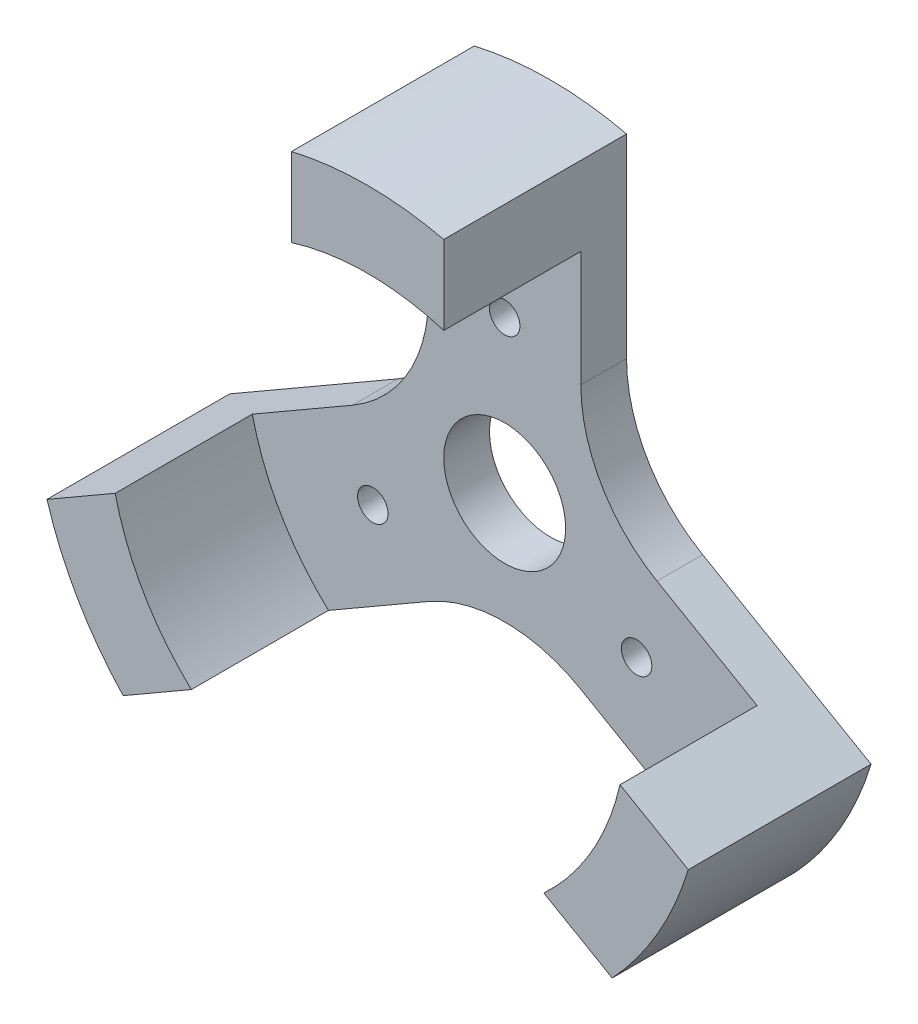
ISO-10303-21;
HEADER;
FILE_DESCRIPTION(('STEP AP214'),'2;1');
FILE_NAME('part.step','',(''),(''),'','','');
FILE_SCHEMA(('AUTOMOTIVE_DESIGN { 1 0 10303 214 1 1 1 1 }'));
ENDSEC;
DATA;
#1=APPLICATION_CONTEXT('core data for automotive mechanical design processes');
#2=APPLICATION_PROTOCOL_DEFINITION('international standard','automotive_design',2000,#1);
#3=PRODUCT_CONTEXT('',#1,'mechanical');
#4=PRODUCT('Part','Part','',(#3));
#5=PRODUCT_RELATED_PRODUCT_CATEGORY('part','',(#4));
#6=PRODUCT_DEFINITION_FORMATION('','',#4);
#7=PRODUCT_DEFINITION_CONTEXT('part definition',#1,'design');
#8=PRODUCT_DEFINITION('design','',#6,#7);
#9=PRODUCT_DEFINITION_SHAPE('','',#8);
#10=(LENGTH_UNIT() NAMED_UNIT(*) SI_UNIT(.MILLI.,.METRE.));
#11=(NAMED_UNIT(*) PLANE_ANGLE_UNIT() SI_UNIT($,.RADIAN.));
#12=(NAMED_UNIT(*) SI_UNIT($,.STERADIAN.) SOLID_ANGLE_UNIT());
#13=UNCERTAINTY_MEASURE_WITH_UNIT(LENGTH_MEASURE(1.E-05),#10,'distance_accuracy_value','');
#14=(GEOMETRIC_REPRESENTATION_CONTEXT(3) GLOBAL_UNCERTAINTY_ASSIGNED_CONTEXT((#13)) GLOBAL_UNIT_ASSIGNED_CONTEXT((#10,
#11,#12)) REPRESENTATION_CONTEXT('',''));
#15=CARTESIAN_POINT('',(0.,0.,0.));
#16=DIRECTION('',(0.,0.,1.));
#17=DIRECTION('',(1.,0.,0.));
#18=AXIS2_PLACEMENT_3D('',#15,#16,#17);
#19=CARTESIAN_POINT('',(0.,0.,9.));
#20=DIRECTION('',(0.,0.,1.));
#21=DIRECTION('',(1.,0.,0.));
#22=AXIS2_PLACEMENT_3D('',#19,#20,#21);
#23=PLANE('',#22);
#24=DIRECTION('',(-2.69994777489102E-13,-1.,0.));
#25=VECTOR('',#24,1.);
#26=CARTESIAN_POINT('',(5.00000000001343,-1.34997388744914E-12,9.));
#27=LINE('',#26,#25);
#28=CARTESIAN_POINT('',(5.00000000001922,21.4242852856241,9.));
#29=VERTEX_POINT('',#28);
#30=CARTESIAN_POINT('',(5.00000000001782,16.2480768092664,9.));
#31=VERTEX_POINT('',#30);
#32=EDGE_CURVE('E332',#29,#31,#27,.T.);
#33=ORIENTED_EDGE('',*,*,#32,.F.);
#34=CARTESIAN_POINT('',(0.,0.,9.));
#35=DIRECTION('',(0.,0.,1.));
#36=DIRECTION('',(1.,0.,0.));
#37=AXIS2_PLACEMENT_3D('',#34,#35,#36);
#38=CIRCLE('',#37,22.);
#39=CARTESIAN_POINT('',(-5.,21.4242852856285,9.));
#40=VERTEX_POINT('',#39);
#41=EDGE_CURVE('E245',#29,#40,#38,.T.);
#42=ORIENTED_EDGE('',*,*,#41,.T.);
#43=DIRECTION('',(0.,1.,0.));
#44=VECTOR('',#43,1.);
#45=CARTESIAN_POINT('',(-5.,0.,9.));
#46=LINE('',#45,#44);
#47=CARTESIAN_POINT('',(-5.,16.2480768092719,9.));
#48=VERTEX_POINT('',#47);
#49=EDGE_CURVE('E419',#48,#40,#46,.T.);
#50=ORIENTED_EDGE('',*,*,#49,.F.);
#51=CARTESIAN_POINT('',(0.,0.,9.));
#52=DIRECTION('',(0.,0.,1.));
#53=DIRECTION('',(1.,0.,0.));
#54=AXIS2_PLACEMENT_3D('',#51,#52,#53);
#55=CIRCLE('',#54,17.);
#56=EDGE_CURVE('E229',#31,#48,#55,.T.);
#57=ORIENTED_EDGE('',*,*,#56,.F.);
#58=EDGE_LOOP('',(#33,#42,#50,#57));
#59=FACE_BOUND('',#58,.T.);
#60=ADVANCED_FACE('F38',(#59),#23,.T.);
#61=DIRECTION('',(0.866025403784439,-0.5,0.));
#62=VECTOR('',#61,1.);
#63=CARTESIAN_POINT('',(2.49999999999903,4.3301270189205,9.));
#64=LINE('',#63,#62);
#65=CARTESIAN_POINT('',(16.5712472794698,-3.79391138571576,9.));
#66=VERTEX_POINT('',#65);
#67=CARTESIAN_POINT('',(21.0539753152789,-6.382015623894,9.));
#68=VERTEX_POINT('',#67);
#69=EDGE_CURVE('E321',#66,#68,#64,.T.);
#70=ORIENTED_EDGE('',*,*,#69,.F.);
#71=CARTESIAN_POINT('',(11.5712472794698,-12.4541654235586,9.));
#72=VERTEX_POINT('',#71);
#73=EDGE_CURVE('E223',#72,#66,#55,.T.);
#74=ORIENTED_EDGE('',*,*,#73,.F.);
#75=DIRECTION('',(-0.866025403784439,0.5,0.));
#76=VECTOR('',#75,1.);
#77=CARTESIAN_POINT('',(-2.50000000000032,-4.33012701892275,9.));
#78=LINE('',#77,#76);
#79=CARTESIAN_POINT('',(16.053975315279,-15.042269661737,9.));
#80=VERTEX_POINT('',#79);
#81=EDGE_CURVE('E440',#80,#72,#78,.T.);
#82=ORIENTED_EDGE('',*,*,#81,.F.);
#83=EDGE_CURVE('E238',#80,#68,#38,.T.);
#84=ORIENTED_EDGE('',*,*,#83,.T.);
#85=EDGE_LOOP('',(#70,#74,#82,#84));
#86=FACE_BOUND('',#85,.T.);
#87=ADVANCED_FACE('F376',(#86),#23,.T.);
#88=CARTESIAN_POINT('',(0.,0.,9.));
#89=DIRECTION('',(0.,0.,-1.));
#90=DIRECTION('',(-1.,0.,0.));
#91=AXIS2_PLACEMENT_3D('',#88,#89,#90);
#92=CYLINDRICAL_SURFACE('',#91,22.);
#93=ORIENTED_EDGE('',*,*,#41,.F.);
#94=DIRECTION('',(0.,0.,-1.));
#95=VECTOR('',#94,1.);
#96=CARTESIAN_POINT('',(5.00000000001922,21.4242852856241,9.));
#97=LINE('',#96,#95);
#98=CARTESIAN_POINT('',(5.00000000001922,21.4242852856241,-3.));
#99=VERTEX_POINT('',#98);
#100=EDGE_CURVE('E335',#29,#99,#97,.T.);
#101=ORIENTED_EDGE('',*,*,#100,.T.);
#102=CARTESIAN_POINT('',(0.,0.,-3.));
#103=DIRECTION('',(0.,0.,-1.));
#104=DIRECTION('',(-1.,0.,0.));
#105=AXIS2_PLACEMENT_3D('',#102,#103,#104);
#106=CIRCLE('',#105,22.);
#107=CARTESIAN_POINT('',(-5.,21.4242852856285,-3.));
#108=VERTEX_POINT('',#107);
#109=EDGE_CURVE('E196',#108,#99,#106,.T.);
#110=ORIENTED_EDGE('',*,*,#109,.F.);
#111=DIRECTION('',(0.,0.,-1.));
#112=VECTOR('',#111,1.);
#113=CARTESIAN_POINT('',(-5.,21.4242852856285,9.));
#114=LINE('',#113,#112);
#115=EDGE_CURVE('E422',#108,#40,#114,.F.);
#116=ORIENTED_EDGE('',*,*,#115,.T.);
#117=EDGE_LOOP('',(#93,#101,#110,#116));
#118=FACE_BOUND('',#117,.T.);
#119=ADVANCED_FACE('F382',(#118),#92,.T.);
#120=CARTESIAN_POINT('',(21.0539753152789,-6.382015623894,-3.));
#121=VERTEX_POINT('',#120);
#122=CARTESIAN_POINT('',(16.053975315279,-15.042269661737,-3.));
#123=VERTEX_POINT('',#122);
#124=EDGE_CURVE('E193',#121,#123,#106,.T.);
#125=ORIENTED_EDGE('',*,*,#124,.F.);
#126=DIRECTION('',(0.,0.,-1.));
#127=VECTOR('',#126,1.);
#128=CARTESIAN_POINT('',(21.0539753152789,-6.382015623894,9.));
#129=LINE('',#128,#127);
#130=EDGE_CURVE('E313',#121,#68,#129,.F.);
#131=ORIENTED_EDGE('',*,*,#130,.T.);
#132=ORIENTED_EDGE('',*,*,#83,.F.);
#133=DIRECTION('',(0.,0.,-1.));
#134=VECTOR('',#133,1.);
#135=CARTESIAN_POINT('',(16.053975315279,-15.0422696617369,9.));
#136=LINE('',#135,#134);
#137=EDGE_CURVE('E443',#80,#123,#136,.T.);
#138=ORIENTED_EDGE('',*,*,#137,.T.);
#139=EDGE_LOOP('',(#125,#131,#132,#138));
#140=FACE_BOUND('',#139,.T.);
#141=ADVANCED_FACE('F392',(#140),#92,.T.);
#142=CARTESIAN_POINT('',(0.,0.,9.));
#143=DIRECTION('',(0.,0.,-1.));
#144=DIRECTION('',(-1.,0.,0.));
#145=AXIS2_PLACEMENT_3D('',#142,#143,#144);
#146=CYLINDRICAL_SURFACE('',#145,17.);
#147=DIRECTION('',(0.,0.,-1.));
#148=VECTOR('',#147,1.);
#149=CARTESIAN_POINT('',(5.00000000001782,16.2480768092664,9.));
#150=LINE('',#149,#148);
#151=CARTESIAN_POINT('',(5.00000000001782,16.2480768092664,0.));
#152=VERTEX_POINT('',#151);
#153=EDGE_CURVE('E311',#31,#152,#150,.T.);
#154=ORIENTED_EDGE('',*,*,#153,.F.);
#155=ORIENTED_EDGE('',*,*,#56,.T.);
#156=DIRECTION('',(0.,0.,-1.));
#157=VECTOR('',#156,1.);
#158=CARTESIAN_POINT('',(-5.,16.2480768092719,9.));
#159=LINE('',#158,#157);
#160=CARTESIAN_POINT('',(-5.,16.2480768092719,0.));
#161=VERTEX_POINT('',#160);
#162=EDGE_CURVE('E416',#161,#48,#159,.F.);
#163=ORIENTED_EDGE('',*,*,#162,.F.);
#164=CARTESIAN_POINT('',(0.,0.,0.));
#165=DIRECTION('',(0.,0.,1.));
#166=DIRECTION('',(1.,0.,0.));
#167=AXIS2_PLACEMENT_3D('',#164,#165,#166);
#168=CIRCLE('',#167,17.);
#169=EDGE_CURVE('E214',#152,#161,#168,.T.);
#170=ORIENTED_EDGE('',*,*,#169,.F.);
#171=EDGE_LOOP('',(#154,#155,#163,#170));
#172=FACE_BOUND('',#171,.T.);
#173=ADVANCED_FACE('F393',(#172),#146,.F.);
#174=DIRECTION('',(0.,0.,-1.));
#175=VECTOR('',#174,1.);
#176=CARTESIAN_POINT('',(16.5712472794698,-3.79391138571576,9.));
#177=LINE('',#176,#175);
#178=CARTESIAN_POINT('',(16.5712472794698,-3.79391138571576,0.));
#179=VERTEX_POINT('',#178);
#180=EDGE_CURVE('E326',#179,#66,#177,.F.);
#181=ORIENTED_EDGE('',*,*,#180,.F.);
#182=CARTESIAN_POINT('',(11.5712472794698,-12.4541654235586,0.));
#183=VERTEX_POINT('',#182);
#184=EDGE_CURVE('E207',#183,#179,#168,.T.);
#185=ORIENTED_EDGE('',*,*,#184,.F.);
#186=DIRECTION('',(0.,0.,-1.));
#187=VECTOR('',#186,1.);
#188=CARTESIAN_POINT('',(11.5712472794698,-12.4541654235586,9.));
#189=LINE('',#188,#187);
#190=EDGE_CURVE('E436',#72,#183,#189,.T.);
#191=ORIENTED_EDGE('',*,*,#190,.F.);
#192=ORIENTED_EDGE('',*,*,#73,.T.);
#193=EDGE_LOOP('',(#181,#185,#191,#192));
#194=FACE_BOUND('',#193,.T.);
#195=ADVANCED_FACE('F386',(#194),#146,.F.);
#196=DIRECTION('',(-0.866025403784434,-0.500000000000009,0.));
#197=VECTOR('',#196,1.);
#198=CARTESIAN_POINT('',(2.49999999999319,-4.3301270189103,9.));
#199=LINE('',#198,#197);
#200=CARTESIAN_POINT('',(-11.5712472794807,-12.4541654235485,9.));
#201=VERTEX_POINT('',#200);
#202=CARTESIAN_POINT('',(-16.0539753152889,-15.0422696617264,9.));
#203=VERTEX_POINT('',#202);
#204=EDGE_CURVE('E396',#201,#203,#199,.T.);
#205=ORIENTED_EDGE('',*,*,#204,.F.);
#206=CARTESIAN_POINT('',(-16.5712472794715,-3.79391138570842,9.));
#207=VERTEX_POINT('',#206);
#208=EDGE_CURVE('E228',#207,#201,#55,.T.);
#209=ORIENTED_EDGE('',*,*,#208,.F.);
#210=DIRECTION('',(0.866025403784447,0.499999999999985,0.));
#211=VECTOR('',#210,1.);
#212=CARTESIAN_POINT('',(-2.50000000000241,4.33012701892654,9.));
#213=LINE('',#212,#211);
#214=CARTESIAN_POINT('',(-21.0539753152811,-6.38201562388684,9.));
#215=VERTEX_POINT('',#214);
#216=EDGE_CURVE('E186',#215,#207,#213,.T.);
#217=ORIENTED_EDGE('',*,*,#216,.F.);
#218=EDGE_CURVE('E183',#215,#203,#38,.T.);
#219=ORIENTED_EDGE('',*,*,#218,.T.);
#220=EDGE_LOOP('',(#205,#209,#217,#219));
#221=FACE_BOUND('',#220,.T.);
#222=ADVANCED_FACE('F378',(#221),#23,.T.);
#223=CARTESIAN_POINT('',(-16.0539753152889,-15.0422696617264,-3.));
#224=VERTEX_POINT('',#223);
#225=CARTESIAN_POINT('',(-21.0539753152811,-6.38201562388684,-3.));
#226=VERTEX_POINT('',#225);
#227=EDGE_CURVE('E181',#224,#226,#106,.T.);
#228=ORIENTED_EDGE('',*,*,#227,.F.);
#229=DIRECTION('',(0.,0.,-1.));
#230=VECTOR('',#229,1.);
#231=CARTESIAN_POINT('',(-16.0539753152889,-15.0422696617264,9.));
#232=LINE('',#231,#230);
#233=EDGE_CURVE('E398',#224,#203,#232,.F.);
#234=ORIENTED_EDGE('',*,*,#233,.T.);
#235=ORIENTED_EDGE('',*,*,#218,.F.);
#236=DIRECTION('',(0.,0.,-1.));
#237=VECTOR('',#236,1.);
#238=CARTESIAN_POINT('',(-21.0539753152811,-6.38201562388684,9.));
#239=LINE('',#238,#237);
#240=EDGE_CURVE('E167',#215,#226,#239,.T.);
#241=ORIENTED_EDGE('',*,*,#240,.T.);
#242=EDGE_LOOP('',(#228,#234,#235,#241));
#243=FACE_BOUND('',#242,.T.);
#244=ADVANCED_FACE('F179',(#243),#92,.T.);
#245=DIRECTION('',(0.,0.,-1.));
#246=VECTOR('',#245,1.);
#247=CARTESIAN_POINT('',(-11.5712472794807,-12.4541654235485,9.));
#248=LINE('',#247,#246);
#249=CARTESIAN_POINT('',(-11.5712472794807,-12.4541654235485,0.));
#250=VERTEX_POINT('',#249);
#251=EDGE_CURVE('E399',#250,#201,#248,.F.);
#252=ORIENTED_EDGE('',*,*,#251,.F.);
#253=CARTESIAN_POINT('',(-16.5712472794715,-3.79391138570842,0.));
#254=VERTEX_POINT('',#253);
#255=EDGE_CURVE('E212',#254,#250,#168,.T.);
#256=ORIENTED_EDGE('',*,*,#255,.F.);
#257=DIRECTION('',(0.,0.,-1.));
#258=VECTOR('',#257,1.);
#259=CARTESIAN_POINT('',(-16.5712472794715,-3.79391138570842,9.));
#260=LINE('',#259,#258);
#261=EDGE_CURVE('E406',#207,#254,#260,.T.);
#262=ORIENTED_EDGE('',*,*,#261,.F.);
#263=ORIENTED_EDGE('',*,*,#208,.T.);
#264=EDGE_LOOP('',(#252,#256,#262,#263));
#265=FACE_BOUND('',#264,.T.);
#266=ADVANCED_FACE('F371',(#265),#146,.F.);
#267=CARTESIAN_POINT('',(0.,0.,0.));
#268=DIRECTION('',(0.,0.,-1.));
#269=DIRECTION('',(-1.,0.,0.));
#270=AXIS2_PLACEMENT_3D('',#267,#268,#269);
#271=PLANE('',#270);
#272=CARTESIAN_POINT('',(0.,0.,0.));
#273=DIRECTION('',(0.,0.,-1.));
#274=DIRECTION('',(-1.,0.,0.));
#275=AXIS2_PLACEMENT_3D('',#272,#273,#274);
#276=CIRCLE('',#275,4.);
#277=CARTESIAN_POINT('',(-4.,0.,0.));
#278=VERTEX_POINT('',#277);
#279=EDGE_CURVE('E452',#278,#278,#276,.T.);
#280=ORIENTED_EDGE('',*,*,#279,.T.);
#281=EDGE_LOOP('',(#280));
#282=FACE_BOUND('',#281,.T.);
#283=CARTESIAN_POINT('',(0.,10.,0.));
#284=DIRECTION('',(0.,0.,-1.));
#285=DIRECTION('',(-1.,0.,0.));
#286=AXIS2_PLACEMENT_3D('',#283,#284,#285);
#287=CIRCLE('',#286,1.);
#288=CARTESIAN_POINT('',(-1.,10.,0.));
#289=VERTEX_POINT('',#288);
#290=EDGE_CURVE('E194',#289,#289,#287,.T.);
#291=ORIENTED_EDGE('',*,*,#290,.T.);
#292=EDGE_LOOP('',(#291));
#293=FACE_BOUND('',#292,.T.);
#294=CARTESIAN_POINT('',(-8.66025403784503,-4.99999999999962,0.));
#295=DIRECTION('',(0.,0.,-1.));
#296=DIRECTION('',(-1.,0.,0.));
#297=AXIS2_PLACEMENT_3D('',#294,#295,#296);
#298=CIRCLE('',#297,1.00000000000056);
#299=CARTESIAN_POINT('',(-9.66025403784558,-4.99999999999962,0.));
#300=VERTEX_POINT('',#299);
#301=EDGE_CURVE('E343',#300,#300,#298,.T.);
#302=ORIENTED_EDGE('',*,*,#301,.T.);
#303=EDGE_LOOP('',(#302));
#304=FACE_BOUND('',#303,.T.);
#305=CARTESIAN_POINT('',(8.66025403784375,-5.00000000000037,0.));
#306=DIRECTION('',(0.,0.,-1.));
#307=DIRECTION('',(-1.,0.,0.));
#308=AXIS2_PLACEMENT_3D('',#305,#306,#307);
#309=CIRCLE('',#308,1.00000000000081);
#310=CARTESIAN_POINT('',(7.66025403784294,-5.00000000000037,0.));
#311=VERTEX_POINT('',#310);
#312=EDGE_CURVE('E351',#311,#311,#309,.T.);
#313=ORIENTED_EDGE('',*,*,#312,.T.);
#314=EDGE_LOOP('',(#313));
#315=FACE_BOUND('',#314,.T.);
#316=DIRECTION('',(-0.866025403784439,0.5,0.));
#317=VECTOR('',#316,1.);
#318=CARTESIAN_POINT('',(2.49999999999903,4.3301270189205,0.));
#319=LINE('',#318,#317);
#320=CARTESIAN_POINT('',(10.0000000000158,-1.13598366824341E-11,0.));
#321=VERTEX_POINT('',#320);
#322=EDGE_CURVE('E305',#179,#321,#319,.T.);
#323=ORIENTED_EDGE('',*,*,#322,.T.);
#324=CARTESIAN_POINT('',(15.0000000000158,8.66025403783303,0.));
#325=DIRECTION('',(0.,0.,-1.));
#326=DIRECTION('',(-1.,0.,0.));
#327=AXIS2_PLACEMENT_3D('',#324,#325,#326);
#328=CIRCLE('',#327,10.);
#329=CARTESIAN_POINT('',(5.00000000001577,8.66025403783573,0.));
#330=VERTEX_POINT('',#329);
#331=EDGE_CURVE('E297',#321,#330,#328,.T.);
#332=ORIENTED_EDGE('',*,*,#331,.T.);
#333=DIRECTION('',(2.69994777489102E-13,1.,0.));
#334=VECTOR('',#333,1.);
#335=CARTESIAN_POINT('',(5.00000000001343,-1.34997388744914E-12,0.));
#336=LINE('',#335,#334);
#337=EDGE_CURVE('E303',#330,#152,#336,.T.);
#338=ORIENTED_EDGE('',*,*,#337,.T.);
#339=ORIENTED_EDGE('',*,*,#169,.T.);
#340=DIRECTION('',(0.,-1.,0.));
#341=VECTOR('',#340,1.);
#342=CARTESIAN_POINT('',(-5.,0.,0.));
#343=LINE('',#342,#341);
#344=CARTESIAN_POINT('',(-5.,8.66025403785029,0.));
#345=VERTEX_POINT('',#344);
#346=EDGE_CURVE('E185',#161,#345,#343,.T.);
#347=ORIENTED_EDGE('',*,*,#346,.T.);
#348=CARTESIAN_POINT('',(-15.,8.66025403785029,0.));
#349=DIRECTION('',(0.,0.,-1.));
#350=DIRECTION('',(-1.,0.,0.));
#351=AXIS2_PLACEMENT_3D('',#348,#349,#350);
#352=CIRCLE('',#351,10.);
#353=CARTESIAN_POINT('',(-10.0000000000001,5.81999726190219E-12,0.));
#354=VERTEX_POINT('',#353);
#355=EDGE_CURVE('E278',#345,#354,#352,.T.);
#356=ORIENTED_EDGE('',*,*,#355,.T.);
#357=DIRECTION('',(-0.866025403784447,-0.499999999999985,0.));
#358=VECTOR('',#357,1.);
#359=CARTESIAN_POINT('',(-2.50000000000241,4.33012701892654,0.));
#360=LINE('',#359,#358);
#361=EDGE_CURVE('E173',#354,#254,#360,.T.);
#362=ORIENTED_EDGE('',*,*,#361,.T.);
#363=ORIENTED_EDGE('',*,*,#255,.T.);
#364=DIRECTION('',(0.866025403784434,0.500000000000009,0.));
#365=VECTOR('',#364,1.);
#366=CARTESIAN_POINT('',(2.49999999999319,-4.3301270189103,0.));
#367=LINE('',#366,#365);
#368=CARTESIAN_POINT('',(-5.00000000001434,-8.66025403783695,0.));
#369=VERTEX_POINT('',#368);
#370=EDGE_CURVE('E426',#250,#369,#367,.T.);
#371=ORIENTED_EDGE('',*,*,#370,.T.);
#372=CARTESIAN_POINT('',(-1.42527049190599E-11,-17.3205080756813,0.));
#373=DIRECTION('',(0.,0.,-1.));
#374=DIRECTION('',(-1.,0.,0.));
#375=AXIS2_PLACEMENT_3D('',#372,#373,#374);
#376=CIRCLE('',#375,10.);
#377=CARTESIAN_POINT('',(4.99999999998575,-8.6602540378369,0.));
#378=VERTEX_POINT('',#377);
#379=EDGE_CURVE('E11',#369,#378,#376,.T.);
#380=ORIENTED_EDGE('',*,*,#379,.T.);
#381=DIRECTION('',(0.866025403784439,-0.5,0.));
#382=VECTOR('',#381,1.);
#383=CARTESIAN_POINT('',(-2.50000000000032,-4.33012701892275,0.));
#384=LINE('',#383,#382);
#385=EDGE_CURVE('E433',#378,#183,#384,.T.);
#386=ORIENTED_EDGE('',*,*,#385,.T.);
#387=ORIENTED_EDGE('',*,*,#184,.T.);
#388=EDGE_LOOP('',(#323,#332,#338,#339,#347,#356,#362,#363,#371,#380,#386,#387));
#389=FACE_BOUND('',#388,.T.);
#390=ADVANCED_FACE('F302',(#282,#293,#304,#315,#389),#271,.F.);
#391=CARTESIAN_POINT('',(0.,0.,-3.));
#392=DIRECTION('',(0.,0.,-1.));
#393=DIRECTION('',(-1.,0.,0.));
#394=AXIS2_PLACEMENT_3D('',#391,#392,#393);
#395=PLANE('',#394);
#396=CARTESIAN_POINT('',(0.,0.,-3.));
#397=DIRECTION('',(0.,0.,-1.));
#398=DIRECTION('',(-1.,0.,0.));
#399=AXIS2_PLACEMENT_3D('',#396,#397,#398);
#400=CIRCLE('',#399,4.);
#401=CARTESIAN_POINT('',(-4.,0.,-3.));
#402=VERTEX_POINT('',#401);
#403=EDGE_CURVE('E458',#402,#402,#400,.T.);
#404=ORIENTED_EDGE('',*,*,#403,.F.);
#405=EDGE_LOOP('',(#404));
#406=FACE_BOUND('',#405,.T.);
#407=DIRECTION('',(2.69994777489102E-13,1.,0.));
#408=VECTOR('',#407,1.);
#409=CARTESIAN_POINT('',(5.00000000001613,9.99999999998865,-3.));
#410=LINE('',#409,#408);
#411=CARTESIAN_POINT('',(5.00000000001577,8.66025403783573,-3.));
#412=VERTEX_POINT('',#411);
#413=EDGE_CURVE('E174',#412,#99,#410,.T.);
#414=ORIENTED_EDGE('',*,*,#413,.F.);
#415=CARTESIAN_POINT('',(15.0000000000158,8.66025403783303,-3.));
#416=DIRECTION('',(0.,0.,-1.));
#417=DIRECTION('',(-1.,0.,0.));
#418=AXIS2_PLACEMENT_3D('',#415,#416,#417);
#419=CIRCLE('',#418,10.);
#420=CARTESIAN_POINT('',(10.0000000000158,-1.13598366824341E-11,-3.));
#421=VERTEX_POINT('',#420);
#422=EDGE_CURVE('E294',#412,#421,#419,.F.);
#423=ORIENTED_EDGE('',*,*,#422,.T.);
#424=DIRECTION('',(-0.866025403784439,0.5,0.));
#425=VECTOR('',#424,1.);
#426=CARTESIAN_POINT('',(2.49999999999903,4.3301270189205,-3.));
#427=LINE('',#426,#425);
#428=EDGE_CURVE('E264',#121,#421,#427,.T.);
#429=ORIENTED_EDGE('',*,*,#428,.F.);
#430=ORIENTED_EDGE('',*,*,#124,.T.);
#431=DIRECTION('',(0.866025403784439,-0.5,0.));
#432=VECTOR('',#431,1.);
#433=CARTESIAN_POINT('',(6.16025403784347,-9.33012701892241,-3.));
#434=LINE('',#433,#432);
#435=CARTESIAN_POINT('',(4.99999999998575,-8.6602540378369,-3.));
#436=VERTEX_POINT('',#435);
#437=EDGE_CURVE('E450',#436,#123,#434,.T.);
#438=ORIENTED_EDGE('',*,*,#437,.F.);
#439=CARTESIAN_POINT('',(-1.42527049190599E-11,-17.3205080756813,-3.));
#440=DIRECTION('',(0.,0.,-1.));
#441=DIRECTION('',(-1.,0.,0.));
#442=AXIS2_PLACEMENT_3D('',#439,#440,#441);
#443=CIRCLE('',#442,10.);
#444=CARTESIAN_POINT('',(-5.00000000001434,-8.66025403783695,-3.));
#445=VERTEX_POINT('',#444);
#446=EDGE_CURVE('E47',#436,#445,#443,.F.);
#447=ORIENTED_EDGE('',*,*,#446,.T.);
#448=DIRECTION('',(0.866025403784434,0.500000000000009,0.));
#449=VECTOR('',#448,1.);
#450=CARTESIAN_POINT('',(2.49999999999319,-4.3301270189103,-3.));
#451=LINE('',#450,#449);
#452=EDGE_CURVE('E191',#224,#445,#451,.T.);
#453=ORIENTED_EDGE('',*,*,#452,.F.);
#454=ORIENTED_EDGE('',*,*,#227,.T.);
#455=DIRECTION('',(-0.866025403784447,-0.499999999999985,0.));
#456=VECTOR('',#455,1.);
#457=CARTESIAN_POINT('',(-24.7876994583757,-8.53768226298222,-3.));
#458=LINE('',#457,#456);
#459=CARTESIAN_POINT('',(-10.0000000000002,5.81999726190219E-12,-3.));
#460=VERTEX_POINT('',#459);
#461=EDGE_CURVE('E163',#460,#226,#458,.T.);
#462=ORIENTED_EDGE('',*,*,#461,.F.);
#463=CARTESIAN_POINT('',(-15.,8.66025403785029,-3.));
#464=DIRECTION('',(0.,0.,-1.));
#465=DIRECTION('',(-1.,0.,0.));
#466=AXIS2_PLACEMENT_3D('',#463,#464,#465);
#467=CIRCLE('',#466,10.);
#468=CARTESIAN_POINT('',(-5.,8.66025403785029,-3.));
#469=VERTEX_POINT('',#468);
#470=EDGE_CURVE('E275',#460,#469,#467,.F.);
#471=ORIENTED_EDGE('',*,*,#470,.T.);
#472=DIRECTION('',(0.,-1.,0.));
#473=VECTOR('',#472,1.);
#474=CARTESIAN_POINT('',(-5.,0.,-3.));
#475=LINE('',#474,#473);
#476=EDGE_CURVE('E254',#108,#469,#475,.T.);
#477=ORIENTED_EDGE('',*,*,#476,.F.);
#478=ORIENTED_EDGE('',*,*,#109,.T.);
#479=EDGE_LOOP('',(#414,#423,#429,#430,#438,#447,#453,#454,#462,#471,#477,#478));
#480=FACE_BOUND('',#479,.T.);
#481=CARTESIAN_POINT('',(0.,10.,-3.));
#482=DIRECTION('',(0.,0.,-1.));
#483=DIRECTION('',(-1.,0.,0.));
#484=AXIS2_PLACEMENT_3D('',#481,#482,#483);
#485=CIRCLE('',#484,1.);
#486=CARTESIAN_POINT('',(-1.,10.,-3.));
#487=VERTEX_POINT('',#486);
#488=EDGE_CURVE('E201',#487,#487,#485,.T.);
#489=ORIENTED_EDGE('',*,*,#488,.F.);
#490=EDGE_LOOP('',(#489));
#491=FACE_BOUND('',#490,.T.);
#492=CARTESIAN_POINT('',(-8.66025403784503,-4.99999999999962,-3.));
#493=DIRECTION('',(0.,0.,-1.));
#494=DIRECTION('',(-1.,0.,0.));
#495=AXIS2_PLACEMENT_3D('',#492,#493,#494);
#496=CIRCLE('',#495,1.00000000000056);
#497=CARTESIAN_POINT('',(-9.66025403784558,-4.99999999999962,-3.));
#498=VERTEX_POINT('',#497);
#499=EDGE_CURVE('E347',#498,#498,#496,.T.);
#500=ORIENTED_EDGE('',*,*,#499,.F.);
#501=EDGE_LOOP('',(#500));
#502=FACE_BOUND('',#501,.T.);
#503=CARTESIAN_POINT('',(8.66025403784375,-5.00000000000037,-3.));
#504=DIRECTION('',(0.,0.,-1.));
#505=DIRECTION('',(-1.,0.,0.));
#506=AXIS2_PLACEMENT_3D('',#503,#504,#505);
#507=CIRCLE('',#506,1.00000000000081);
#508=CARTESIAN_POINT('',(7.66025403784294,-5.00000000000037,-3.));
#509=VERTEX_POINT('',#508);
#510=EDGE_CURVE('E338',#509,#509,#507,.T.);
#511=ORIENTED_EDGE('',*,*,#510,.F.);
#512=EDGE_LOOP('',(#511));
#513=FACE_BOUND('',#512,.T.);
#514=ADVANCED_FACE('F189',(#406,#480,#491,#502,#513),#395,.T.);
#515=CARTESIAN_POINT('',(8.66025403784375,-5.00000000000037,0.));
#516=DIRECTION('',(0.,0.,-1.));
#517=DIRECTION('',(-1.,0.,0.));
#518=AXIS2_PLACEMENT_3D('',#515,#516,#517);
#519=CYLINDRICAL_SURFACE('',#518,1.00000000000081);
#520=ORIENTED_EDGE('',*,*,#312,.F.);
#521=EDGE_LOOP('',(#520));
#522=FACE_BOUND('',#521,.T.);
#523=ORIENTED_EDGE('',*,*,#510,.T.);
#524=EDGE_LOOP('',(#523));
#525=FACE_BOUND('',#524,.T.);
#526=ADVANCED_FACE('F358',(#522,#525),#519,.F.);
#527=CARTESIAN_POINT('',(-8.66025403784503,-4.99999999999962,0.));
#528=DIRECTION('',(0.,0.,-1.));
#529=DIRECTION('',(-1.,0.,0.));
#530=AXIS2_PLACEMENT_3D('',#527,#528,#529);
#531=CYLINDRICAL_SURFACE('',#530,1.00000000000056);
#532=ORIENTED_EDGE('',*,*,#301,.F.);
#533=EDGE_LOOP('',(#532));
#534=FACE_BOUND('',#533,.T.);
#535=ORIENTED_EDGE('',*,*,#499,.T.);
#536=EDGE_LOOP('',(#535));
#537=FACE_BOUND('',#536,.T.);
#538=ADVANCED_FACE('F368',(#534,#537),#531,.F.);
#539=CARTESIAN_POINT('',(0.,10.,0.));
#540=DIRECTION('',(0.,0.,-1.));
#541=DIRECTION('',(-1.,0.,0.));
#542=AXIS2_PLACEMENT_3D('',#539,#540,#541);
#543=CYLINDRICAL_SURFACE('',#542,1.);
#544=ORIENTED_EDGE('',*,*,#290,.F.);
#545=EDGE_LOOP('',(#544));
#546=FACE_BOUND('',#545,.T.);
#547=ORIENTED_EDGE('',*,*,#488,.T.);
#548=EDGE_LOOP('',(#547));
#549=FACE_BOUND('',#548,.T.);
#550=ADVANCED_FACE('F479',(#546,#549),#543,.F.);
#551=CARTESIAN_POINT('',(-5.,31.0066226371048,22.));
#552=DIRECTION('',(1.,0.,0.));
#553=DIRECTION('',(0.,1.,0.));
#554=AXIS2_PLACEMENT_3D('',#551,#552,#553);
#555=PLANE('',#554);
#556=ORIENTED_EDGE('',*,*,#476,.T.);
#557=DIRECTION('',(0.,0.,-1.));
#558=VECTOR('',#557,1.);
#559=CARTESIAN_POINT('',(-5.,8.66025403785029,0.));
#560=LINE('',#559,#558);
#561=EDGE_CURVE('E272',#469,#345,#560,.F.);
#562=ORIENTED_EDGE('',*,*,#561,.T.);
#563=ORIENTED_EDGE('',*,*,#346,.F.);
#564=ORIENTED_EDGE('',*,*,#162,.T.);
#565=ORIENTED_EDGE('',*,*,#49,.T.);
#566=ORIENTED_EDGE('',*,*,#115,.F.);
#567=EDGE_LOOP('',(#556,#562,#563,#564,#565,#566));
#568=FACE_BOUND('',#567,.T.);
#569=ADVANCED_FACE('F486',(#568),#555,.F.);
#570=CARTESIAN_POINT('',(-24.7876994583757,-8.53768226298222,22.));
#571=DIRECTION('',(0.499999999999985,-0.866025403784447,0.));
#572=DIRECTION('',(0.866025403784447,0.499999999999985,0.));
#573=AXIS2_PLACEMENT_3D('',#570,#571,#572);
#574=PLANE('',#573);
#575=ORIENTED_EDGE('',*,*,#361,.F.);
#576=DIRECTION('',(0.,0.,-1.));
#577=VECTOR('',#576,1.);
#578=CARTESIAN_POINT('',(-10.0000000000002,5.82022967077943E-12,-3.));
#579=LINE('',#578,#577);
#580=EDGE_CURVE('E170',#354,#460,#579,.T.);
#581=ORIENTED_EDGE('',*,*,#580,.T.);
#582=ORIENTED_EDGE('',*,*,#461,.T.);
#583=ORIENTED_EDGE('',*,*,#240,.F.);
#584=ORIENTED_EDGE('',*,*,#216,.T.);
#585=ORIENTED_EDGE('',*,*,#261,.T.);
#586=EDGE_LOOP('',(#575,#581,#582,#583,#584,#585));
#587=FACE_BOUND('',#586,.T.);
#588=ADVANCED_FACE('F166',(#587),#574,.F.);
#589=CARTESIAN_POINT('',(6.16025403784347,-9.33012701892241,22.));
#590=DIRECTION('',(0.5,0.866025403784438,0.));
#591=DIRECTION('',(-0.866025403784439,0.5,0.));
#592=AXIS2_PLACEMENT_3D('',#589,#590,#591);
#593=PLANE('',#592);
#594=ORIENTED_EDGE('',*,*,#385,.F.);
#595=DIRECTION('',(0.,0.,-1.));
#596=VECTOR('',#595,1.);
#597=CARTESIAN_POINT('',(4.99999999998575,-8.6602540378369,-3.));
#598=LINE('',#597,#596);
#599=EDGE_CURVE('E288',#378,#436,#598,.T.);
#600=ORIENTED_EDGE('',*,*,#599,.T.);
#601=ORIENTED_EDGE('',*,*,#437,.T.);
#602=ORIENTED_EDGE('',*,*,#137,.F.);
#603=ORIENTED_EDGE('',*,*,#81,.T.);
#604=ORIENTED_EDGE('',*,*,#190,.T.);
#605=EDGE_LOOP('',(#594,#600,#601,#602,#603,#604));
#606=FACE_BOUND('',#605,.T.);
#607=ADVANCED_FACE('F492',(#606),#593,.F.);
#608=CARTESIAN_POINT('',(-19.7876994583805,-17.1979363008201,22.));
#609=DIRECTION('',(-0.500000000000009,0.866025403784434,0.));
#610=DIRECTION('',(-0.866025403784434,-0.500000000000009,0.));
#611=AXIS2_PLACEMENT_3D('',#608,#609,#610);
#612=PLANE('',#611);
#613=ORIENTED_EDGE('',*,*,#452,.T.);
#614=DIRECTION('',(0.,0.,-1.));
#615=VECTOR('',#614,1.);
#616=CARTESIAN_POINT('',(-5.00000000001434,-8.66025403783695,0.));
#617=LINE('',#616,#615);
#618=EDGE_CURVE('E54',#445,#369,#617,.F.);
#619=ORIENTED_EDGE('',*,*,#618,.T.);
#620=ORIENTED_EDGE('',*,*,#370,.F.);
#621=ORIENTED_EDGE('',*,*,#251,.T.);
#622=ORIENTED_EDGE('',*,*,#204,.T.);
#623=ORIENTED_EDGE('',*,*,#233,.F.);
#624=EDGE_LOOP('',(#613,#619,#620,#621,#622,#623));
#625=FACE_BOUND('',#624,.T.);
#626=ADVANCED_FACE('F499',(#625),#612,.F.);
#627=CARTESIAN_POINT('',(5.00000000001613,9.99999999998865,22.));
#628=DIRECTION('',(-1.,2.69994777489102E-13,0.));
#629=DIRECTION('',(-2.69994777489102E-13,-1.,0.));
#630=AXIS2_PLACEMENT_3D('',#627,#628,#629);
#631=PLANE('',#630);
#632=ORIENTED_EDGE('',*,*,#337,.F.);
#633=DIRECTION('',(0.,0.,-1.));
#634=VECTOR('',#633,1.);
#635=CARTESIAN_POINT('',(5.00000000001577,8.66025403783573,-3.));
#636=LINE('',#635,#634);
#637=EDGE_CURVE('E281',#330,#412,#636,.T.);
#638=ORIENTED_EDGE('',*,*,#637,.T.);
#639=ORIENTED_EDGE('',*,*,#413,.T.);
#640=ORIENTED_EDGE('',*,*,#100,.F.);
#641=ORIENTED_EDGE('',*,*,#32,.T.);
#642=ORIENTED_EDGE('',*,*,#153,.T.);
#643=EDGE_LOOP('',(#632,#638,#639,#640,#641,#642));
#644=FACE_BOUND('',#643,.T.);
#645=ADVANCED_FACE('F310',(#644),#631,.F.);
#646=CARTESIAN_POINT('',(5.00000000001613,2.88675134593656,22.));
#647=DIRECTION('',(-0.5,-0.866025403784439,0.));
#648=DIRECTION('',(0.866025403784439,-0.5,0.));
#649=AXIS2_PLACEMENT_3D('',#646,#647,#648);
#650=PLANE('',#649);
#651=ORIENTED_EDGE('',*,*,#428,.T.);
#652=DIRECTION('',(0.,0.,-1.));
#653=VECTOR('',#652,1.);
#654=CARTESIAN_POINT('',(10.0000000000158,-1.13583613331692E-11,0.));
#655=LINE('',#654,#653);
#656=EDGE_CURVE('E285',#421,#321,#655,.F.);
#657=ORIENTED_EDGE('',*,*,#656,.T.);
#658=ORIENTED_EDGE('',*,*,#322,.F.);
#659=ORIENTED_EDGE('',*,*,#180,.T.);
#660=ORIENTED_EDGE('',*,*,#69,.T.);
#661=ORIENTED_EDGE('',*,*,#130,.F.);
#662=EDGE_LOOP('',(#651,#657,#658,#659,#660,#661));
#663=FACE_BOUND('',#662,.T.);
#664=ADVANCED_FACE('F319',(#663),#650,.F.);
#665=CARTESIAN_POINT('',(0.,0.,7.));
#666=DIRECTION('',(0.,0.,-1.));
#667=DIRECTION('',(-1.,0.,0.));
#668=AXIS2_PLACEMENT_3D('',#665,#666,#667);
#669=CYLINDRICAL_SURFACE('',#668,4.);
#670=ORIENTED_EDGE('',*,*,#403,.T.);
#671=EDGE_LOOP('',(#670));
#672=FACE_BOUND('',#671,.T.);
#673=ORIENTED_EDGE('',*,*,#279,.F.);
#674=EDGE_LOOP('',(#673));
#675=FACE_BOUND('',#674,.T.);
#676=ADVANCED_FACE('F464',(#672,#675),#669,.F.);
#677=CARTESIAN_POINT('',(-15.,8.66025403785029,22.));
#678=DIRECTION('',(0.,0.,1.));
#679=DIRECTION('',(1.,0.,0.));
#680=AXIS2_PLACEMENT_3D('',#677,#678,#679);
#681=CYLINDRICAL_SURFACE('',#680,10.);
#682=ORIENTED_EDGE('',*,*,#355,.F.);
#683=ORIENTED_EDGE('',*,*,#561,.F.);
#684=ORIENTED_EDGE('',*,*,#470,.F.);
#685=ORIENTED_EDGE('',*,*,#580,.F.);
#686=EDGE_LOOP('',(#682,#683,#684,#685));
#687=FACE_BOUND('',#686,.T.);
#688=ADVANCED_FACE('F467',(#687),#681,.F.);
#689=CARTESIAN_POINT('',(15.0000000000158,8.66025403783303,22.));
#690=DIRECTION('',(0.,0.,1.));
#691=DIRECTION('',(1.,0.,0.));
#692=AXIS2_PLACEMENT_3D('',#689,#690,#691);
#693=CYLINDRICAL_SURFACE('',#692,10.);
#694=ORIENTED_EDGE('',*,*,#331,.F.);
#695=ORIENTED_EDGE('',*,*,#656,.F.);
#696=ORIENTED_EDGE('',*,*,#422,.F.);
#697=ORIENTED_EDGE('',*,*,#637,.F.);
#698=EDGE_LOOP('',(#694,#695,#696,#697));
#699=FACE_BOUND('',#698,.T.);
#700=ADVANCED_FACE('F315',(#699),#693,.F.);
#701=CARTESIAN_POINT('',(-1.42527049190599E-11,-17.3205080756813,22.));
#702=DIRECTION('',(0.,0.,1.));
#703=DIRECTION('',(1.,0.,0.));
#704=AXIS2_PLACEMENT_3D('',#701,#702,#703);
#705=CYLINDRICAL_SURFACE('',#704,10.);
#706=ORIENTED_EDGE('',*,*,#379,.F.);
#707=ORIENTED_EDGE('',*,*,#618,.F.);
#708=ORIENTED_EDGE('',*,*,#446,.F.);
#709=ORIENTED_EDGE('',*,*,#599,.F.);
#710=EDGE_LOOP('',(#706,#707,#708,#709));
#711=FACE_BOUND('',#710,.T.);
#712=ADVANCED_FACE('F40',(#711),#705,.F.);
#713=CLOSED_SHELL('',(#60,#87,#119,#141,#173,#195,#222,#244,#266,#390,#514,#526,#538,#550,#569,
#588,#607,#626,#645,#664,#676,#688,#700,#712));
#714=MANIFOLD_SOLID_BREP('B2',#713);
#715=ADVANCED_BREP_SHAPE_REPRESENTATION('',(#18,#714),#14);
#716=SHAPE_DEFINITION_REPRESENTATION(#9,#715);
ENDSEC;
END-ISO-10303-21;
